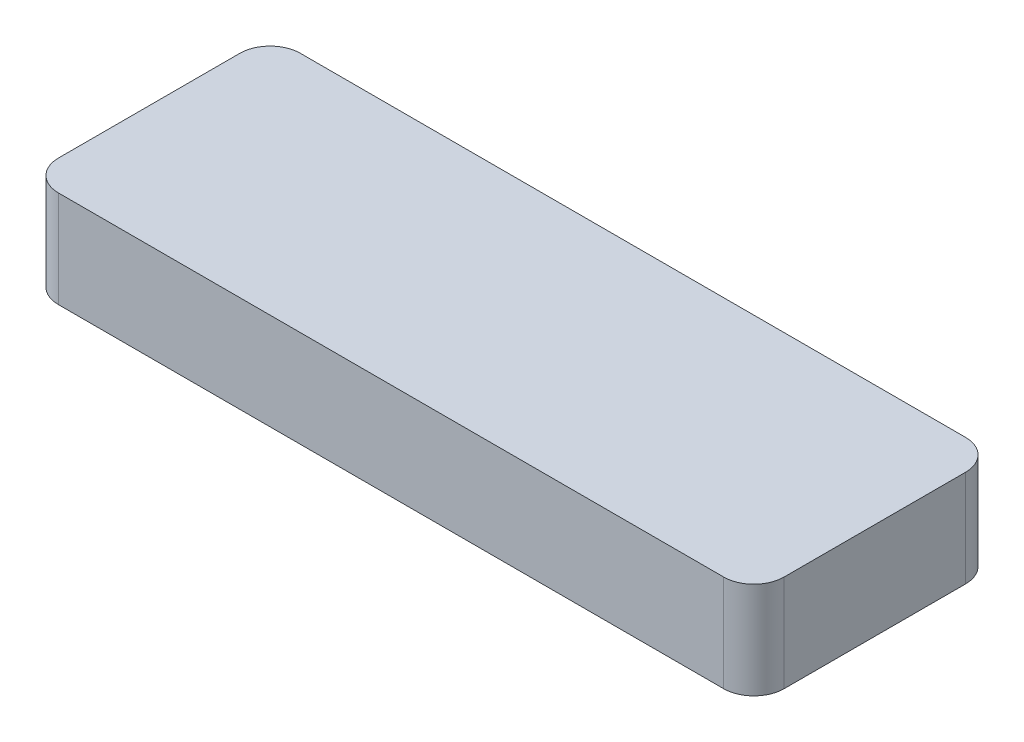
ISO-10303-21;
HEADER;
FILE_DESCRIPTION(('STEP AP214'),'2;1');
FILE_NAME('part.step','',(''),(''),'','','');
FILE_SCHEMA(('AUTOMOTIVE_DESIGN { 1 0 10303 214 1 1 1 1 }'));
ENDSEC;
DATA;
#1=APPLICATION_CONTEXT('core data for automotive mechanical design processes');
#2=APPLICATION_PROTOCOL_DEFINITION('international standard','automotive_design',2000,#1);
#3=PRODUCT_CONTEXT('',#1,'mechanical');
#4=PRODUCT('Part','Part','',(#3));
#5=PRODUCT_RELATED_PRODUCT_CATEGORY('part','',(#4));
#6=PRODUCT_DEFINITION_FORMATION('','',#4);
#7=PRODUCT_DEFINITION_CONTEXT('part definition',#1,'design');
#8=PRODUCT_DEFINITION('design','',#6,#7);
#9=PRODUCT_DEFINITION_SHAPE('','',#8);
#10=(LENGTH_UNIT() NAMED_UNIT(*) SI_UNIT(.MILLI.,.METRE.));
#11=(NAMED_UNIT(*) PLANE_ANGLE_UNIT() SI_UNIT($,.RADIAN.));
#12=(NAMED_UNIT(*) SI_UNIT($,.STERADIAN.) SOLID_ANGLE_UNIT());
#13=UNCERTAINTY_MEASURE_WITH_UNIT(LENGTH_MEASURE(1.E-05),#10,'distance_accuracy_value','');
#14=(GEOMETRIC_REPRESENTATION_CONTEXT(3) GLOBAL_UNCERTAINTY_ASSIGNED_CONTEXT((#13)) GLOBAL_UNIT_ASSIGNED_CONTEXT((#10,
#11,#12)) REPRESENTATION_CONTEXT('',''));
#15=CARTESIAN_POINT('',(0.,0.,0.));
#16=DIRECTION('',(0.,0.,1.));
#17=DIRECTION('',(1.,0.,0.));
#18=AXIS2_PLACEMENT_3D('',#15,#16,#17);
#19=CARTESIAN_POINT('',(60.,16.,-20.));
#20=DIRECTION('',(-1.,0.,0.));
#21=DIRECTION('',(0.,0.,1.));
#22=AXIS2_PLACEMENT_3D('',#19,#20,#21);
#23=PLANE('',#22);
#24=DIRECTION('',(0.,0.,-1.));
#25=VECTOR('',#24,1.);
#26=CARTESIAN_POINT('',(60.,0.,-20.));
#27=LINE('',#26,#25);
#28=CARTESIAN_POINT('',(60.,0.,15.));
#29=VERTEX_POINT('',#28);
#30=CARTESIAN_POINT('',(60.,0.,-15.));
#31=VERTEX_POINT('',#30);
#32=EDGE_CURVE('E140',#29,#31,#27,.T.);
#33=ORIENTED_EDGE('',*,*,#32,.T.);
#34=DIRECTION('',(0.,-1.,0.));
#35=VECTOR('',#34,1.);
#36=CARTESIAN_POINT('',(60.,16.,-15.));
#37=LINE('',#36,#35);
#38=CARTESIAN_POINT('',(60.,16.,-15.));
#39=VERTEX_POINT('',#38);
#40=EDGE_CURVE('E174',#31,#39,#37,.F.);
#41=ORIENTED_EDGE('',*,*,#40,.T.);
#42=DIRECTION('',(0.,0.,-1.));
#43=VECTOR('',#42,1.);
#44=CARTESIAN_POINT('',(60.,16.,-20.));
#45=LINE('',#44,#43);
#46=CARTESIAN_POINT('',(60.,16.,15.));
#47=VERTEX_POINT('',#46);
#48=EDGE_CURVE('E138',#47,#39,#45,.T.);
#49=ORIENTED_EDGE('',*,*,#48,.F.);
#50=DIRECTION('',(0.,-1.,0.));
#51=VECTOR('',#50,1.);
#52=CARTESIAN_POINT('',(60.,16.,15.));
#53=LINE('',#52,#51);
#54=EDGE_CURVE('E170',#47,#29,#53,.T.);
#55=ORIENTED_EDGE('',*,*,#54,.T.);
#56=EDGE_LOOP('',(#33,#41,#49,#55));
#57=FACE_BOUND('',#56,.T.);
#58=ADVANCED_FACE('F39',(#57),#23,.F.);
#59=CARTESIAN_POINT('',(-60.,16.,-20.));
#60=DIRECTION('',(0.,0.,1.));
#61=DIRECTION('',(1.,0.,0.));
#62=AXIS2_PLACEMENT_3D('',#59,#60,#61);
#63=PLANE('',#62);
#64=DIRECTION('',(-1.,0.,0.));
#65=VECTOR('',#64,1.);
#66=CARTESIAN_POINT('',(-60.,0.,-20.));
#67=LINE('',#66,#65);
#68=CARTESIAN_POINT('',(55.,0.,-20.));
#69=VERTEX_POINT('',#68);
#70=CARTESIAN_POINT('',(-55.,0.,-20.));
#71=VERTEX_POINT('',#70);
#72=EDGE_CURVE('E134',#69,#71,#67,.T.);
#73=ORIENTED_EDGE('',*,*,#72,.T.);
#74=DIRECTION('',(0.,-1.,0.));
#75=VECTOR('',#74,1.);
#76=CARTESIAN_POINT('',(-55.,16.,-20.));
#77=LINE('',#76,#75);
#78=CARTESIAN_POINT('',(-55.,16.,-20.));
#79=VERTEX_POINT('',#78);
#80=EDGE_CURVE('E110',#71,#79,#77,.F.);
#81=ORIENTED_EDGE('',*,*,#80,.T.);
#82=DIRECTION('',(-1.,0.,0.));
#83=VECTOR('',#82,1.);
#84=CARTESIAN_POINT('',(-60.,16.,-20.));
#85=LINE('',#84,#83);
#86=CARTESIAN_POINT('',(55.,16.,-20.));
#87=VERTEX_POINT('',#86);
#88=EDGE_CURVE('E193',#87,#79,#85,.T.);
#89=ORIENTED_EDGE('',*,*,#88,.F.);
#90=DIRECTION('',(0.,-1.,0.));
#91=VECTOR('',#90,1.);
#92=CARTESIAN_POINT('',(55.,16.,-20.));
#93=LINE('',#92,#91);
#94=EDGE_CURVE('E116',#87,#69,#93,.T.);
#95=ORIENTED_EDGE('',*,*,#94,.T.);
#96=EDGE_LOOP('',(#73,#81,#89,#95));
#97=FACE_BOUND('',#96,.T.);
#98=ADVANCED_FACE('F214',(#97),#63,.F.);
#99=CARTESIAN_POINT('',(-60.,16.,-20.));
#100=DIRECTION('',(1.,0.,0.));
#101=DIRECTION('',(0.,0.,-1.));
#102=AXIS2_PLACEMENT_3D('',#99,#100,#101);
#103=PLANE('',#102);
#104=DIRECTION('',(0.,0.,1.));
#105=VECTOR('',#104,1.);
#106=CARTESIAN_POINT('',(-60.,16.,-20.));
#107=LINE('',#106,#105);
#108=CARTESIAN_POINT('',(-60.,16.,-15.));
#109=VERTEX_POINT('',#108);
#110=CARTESIAN_POINT('',(-60.,16.,15.));
#111=VERTEX_POINT('',#110);
#112=EDGE_CURVE('E125',#109,#111,#107,.T.);
#113=ORIENTED_EDGE('',*,*,#112,.F.);
#114=DIRECTION('',(0.,-1.,0.));
#115=VECTOR('',#114,1.);
#116=CARTESIAN_POINT('',(-60.,16.,-15.));
#117=LINE('',#116,#115);
#118=CARTESIAN_POINT('',(-60.,0.,-15.));
#119=VERTEX_POINT('',#118);
#120=EDGE_CURVE('E109',#109,#119,#117,.T.);
#121=ORIENTED_EDGE('',*,*,#120,.T.);
#122=DIRECTION('',(0.,0.,1.));
#123=VECTOR('',#122,1.);
#124=CARTESIAN_POINT('',(-60.,0.,-20.));
#125=LINE('',#124,#123);
#126=CARTESIAN_POINT('',(-60.,0.,15.));
#127=VERTEX_POINT('',#126);
#128=EDGE_CURVE('E123',#119,#127,#125,.T.);
#129=ORIENTED_EDGE('',*,*,#128,.T.);
#130=DIRECTION('',(0.,-1.,0.));
#131=VECTOR('',#130,1.);
#132=CARTESIAN_POINT('',(-60.,16.,15.));
#133=LINE('',#132,#131);
#134=EDGE_CURVE('E128',#127,#111,#133,.F.);
#135=ORIENTED_EDGE('',*,*,#134,.T.);
#136=EDGE_LOOP('',(#113,#121,#129,#135));
#137=FACE_BOUND('',#136,.T.);
#138=ADVANCED_FACE('F122',(#137),#103,.F.);
#139=CARTESIAN_POINT('',(-60.,16.,20.));
#140=DIRECTION('',(0.,0.,-1.));
#141=DIRECTION('',(-1.,0.,0.));
#142=AXIS2_PLACEMENT_3D('',#139,#140,#141);
#143=PLANE('',#142);
#144=DIRECTION('',(1.,0.,0.));
#145=VECTOR('',#144,1.);
#146=CARTESIAN_POINT('',(-60.,0.,20.));
#147=LINE('',#146,#145);
#148=CARTESIAN_POINT('',(-55.,0.,20.));
#149=VERTEX_POINT('',#148);
#150=CARTESIAN_POINT('',(55.,0.,20.));
#151=VERTEX_POINT('',#150);
#152=EDGE_CURVE('E133',#149,#151,#147,.T.);
#153=ORIENTED_EDGE('',*,*,#152,.T.);
#154=DIRECTION('',(0.,-1.,0.));
#155=VECTOR('',#154,1.);
#156=CARTESIAN_POINT('',(55.,16.,20.));
#157=LINE('',#156,#155);
#158=CARTESIAN_POINT('',(55.,16.,20.));
#159=VERTEX_POINT('',#158);
#160=EDGE_CURVE('E11',#151,#159,#157,.F.);
#161=ORIENTED_EDGE('',*,*,#160,.T.);
#162=DIRECTION('',(1.,0.,0.));
#163=VECTOR('',#162,1.);
#164=CARTESIAN_POINT('',(-60.,16.,20.));
#165=LINE('',#164,#163);
#166=CARTESIAN_POINT('',(-55.,16.,20.));
#167=VERTEX_POINT('',#166);
#168=EDGE_CURVE('E145',#167,#159,#165,.T.);
#169=ORIENTED_EDGE('',*,*,#168,.F.);
#170=DIRECTION('',(0.,-1.,0.));
#171=VECTOR('',#170,1.);
#172=CARTESIAN_POINT('',(-55.,16.,20.));
#173=LINE('',#172,#171);
#174=EDGE_CURVE('E48',#167,#149,#173,.T.);
#175=ORIENTED_EDGE('',*,*,#174,.T.);
#176=EDGE_LOOP('',(#153,#161,#169,#175));
#177=FACE_BOUND('',#176,.T.);
#178=ADVANCED_FACE('F179',(#177),#143,.F.);
#179=CARTESIAN_POINT('',(0.,16.,0.));
#180=DIRECTION('',(0.,1.,0.));
#181=DIRECTION('',(0.,0.,1.));
#182=AXIS2_PLACEMENT_3D('',#179,#180,#181);
#183=PLANE('',#182);
#184=ORIENTED_EDGE('',*,*,#88,.T.);
#185=CARTESIAN_POINT('',(-55.,16.,-15.));
#186=DIRECTION('',(0.,1.,0.));
#187=DIRECTION('',(0.,0.,1.));
#188=AXIS2_PLACEMENT_3D('',#185,#186,#187);
#189=CIRCLE('',#188,5.);
#190=EDGE_CURVE('E167',#79,#109,#189,.T.);
#191=ORIENTED_EDGE('',*,*,#190,.T.);
#192=ORIENTED_EDGE('',*,*,#112,.T.);
#193=CARTESIAN_POINT('',(-55.,16.,15.));
#194=DIRECTION('',(0.,1.,0.));
#195=DIRECTION('',(0.,0.,1.));
#196=AXIS2_PLACEMENT_3D('',#193,#194,#195);
#197=CIRCLE('',#196,5.);
#198=EDGE_CURVE('E60',#111,#167,#197,.T.);
#199=ORIENTED_EDGE('',*,*,#198,.T.);
#200=ORIENTED_EDGE('',*,*,#168,.T.);
#201=CARTESIAN_POINT('',(55.,16.,15.));
#202=DIRECTION('',(0.,1.,0.));
#203=DIRECTION('',(0.,0.,1.));
#204=AXIS2_PLACEMENT_3D('',#201,#202,#203);
#205=CIRCLE('',#204,5.);
#206=EDGE_CURVE('E161',#159,#47,#205,.T.);
#207=ORIENTED_EDGE('',*,*,#206,.T.);
#208=ORIENTED_EDGE('',*,*,#48,.T.);
#209=CARTESIAN_POINT('',(55.,16.,-15.));
#210=DIRECTION('',(0.,1.,0.));
#211=DIRECTION('',(0.,0.,1.));
#212=AXIS2_PLACEMENT_3D('',#209,#210,#211);
#213=CIRCLE('',#212,5.);
#214=EDGE_CURVE('E164',#39,#87,#213,.T.);
#215=ORIENTED_EDGE('',*,*,#214,.T.);
#216=EDGE_LOOP('',(#184,#191,#192,#199,#200,#207,#208,#215));
#217=FACE_BOUND('',#216,.T.);
#218=ADVANCED_FACE('F203',(#217),#183,.T.);
#219=CARTESIAN_POINT('',(0.,0.,0.));
#220=DIRECTION('',(0.,1.,0.));
#221=DIRECTION('',(0.,0.,1.));
#222=AXIS2_PLACEMENT_3D('',#219,#220,#221);
#223=PLANE('',#222);
#224=ORIENTED_EDGE('',*,*,#128,.F.);
#225=CARTESIAN_POINT('',(-55.,0.,-15.));
#226=DIRECTION('',(0.,1.,0.));
#227=DIRECTION('',(0.,0.,1.));
#228=AXIS2_PLACEMENT_3D('',#225,#226,#227);
#229=CIRCLE('',#228,5.);
#230=EDGE_CURVE('E105',#119,#71,#229,.F.);
#231=ORIENTED_EDGE('',*,*,#230,.T.);
#232=ORIENTED_EDGE('',*,*,#72,.F.);
#233=CARTESIAN_POINT('',(55.,0.,-15.));
#234=DIRECTION('',(0.,1.,0.));
#235=DIRECTION('',(0.,0.,1.));
#236=AXIS2_PLACEMENT_3D('',#233,#234,#235);
#237=CIRCLE('',#236,5.);
#238=EDGE_CURVE('E117',#69,#31,#237,.F.);
#239=ORIENTED_EDGE('',*,*,#238,.T.);
#240=ORIENTED_EDGE('',*,*,#32,.F.);
#241=CARTESIAN_POINT('',(55.,0.,15.));
#242=DIRECTION('',(0.,1.,0.));
#243=DIRECTION('',(0.,0.,1.));
#244=AXIS2_PLACEMENT_3D('',#241,#242,#243);
#245=CIRCLE('',#244,5.);
#246=EDGE_CURVE('E149',#29,#151,#245,.F.);
#247=ORIENTED_EDGE('',*,*,#246,.T.);
#248=ORIENTED_EDGE('',*,*,#152,.F.);
#249=CARTESIAN_POINT('',(-55.,0.,15.));
#250=DIRECTION('',(0.,1.,0.));
#251=DIRECTION('',(0.,0.,1.));
#252=AXIS2_PLACEMENT_3D('',#249,#250,#251);
#253=CIRCLE('',#252,5.);
#254=EDGE_CURVE('E127',#149,#127,#253,.F.);
#255=ORIENTED_EDGE('',*,*,#254,.T.);
#256=EDGE_LOOP('',(#224,#231,#232,#239,#240,#247,#248,#255));
#257=FACE_BOUND('',#256,.T.);
#258=ADVANCED_FACE('F130',(#257),#223,.F.);
#259=CARTESIAN_POINT('',(-55.,16.,-15.));
#260=DIRECTION('',(0.,-1.,0.));
#261=DIRECTION('',(0.,0.,-1.));
#262=AXIS2_PLACEMENT_3D('',#259,#260,#261);
#263=CYLINDRICAL_SURFACE('',#262,5.);
#264=ORIENTED_EDGE('',*,*,#190,.F.);
#265=ORIENTED_EDGE('',*,*,#80,.F.);
#266=ORIENTED_EDGE('',*,*,#230,.F.);
#267=ORIENTED_EDGE('',*,*,#120,.F.);
#268=EDGE_LOOP('',(#264,#265,#266,#267));
#269=FACE_BOUND('',#268,.T.);
#270=ADVANCED_FACE('F108',(#269),#263,.T.);
#271=CARTESIAN_POINT('',(55.,16.,-15.));
#272=DIRECTION('',(0.,-1.,0.));
#273=DIRECTION('',(0.,0.,-1.));
#274=AXIS2_PLACEMENT_3D('',#271,#272,#273);
#275=CYLINDRICAL_SURFACE('',#274,5.);
#276=ORIENTED_EDGE('',*,*,#214,.F.);
#277=ORIENTED_EDGE('',*,*,#40,.F.);
#278=ORIENTED_EDGE('',*,*,#238,.F.);
#279=ORIENTED_EDGE('',*,*,#94,.F.);
#280=EDGE_LOOP('',(#276,#277,#278,#279));
#281=FACE_BOUND('',#280,.T.);
#282=ADVANCED_FACE('F225',(#281),#275,.T.);
#283=CARTESIAN_POINT('',(55.,16.,15.));
#284=DIRECTION('',(0.,-1.,0.));
#285=DIRECTION('',(0.,0.,-1.));
#286=AXIS2_PLACEMENT_3D('',#283,#284,#285);
#287=CYLINDRICAL_SURFACE('',#286,5.);
#288=ORIENTED_EDGE('',*,*,#206,.F.);
#289=ORIENTED_EDGE('',*,*,#160,.F.);
#290=ORIENTED_EDGE('',*,*,#246,.F.);
#291=ORIENTED_EDGE('',*,*,#54,.F.);
#292=EDGE_LOOP('',(#288,#289,#290,#291));
#293=FACE_BOUND('',#292,.T.);
#294=ADVANCED_FACE('F186',(#293),#287,.T.);
#295=CARTESIAN_POINT('',(-55.,16.,15.));
#296=DIRECTION('',(0.,-1.,0.));
#297=DIRECTION('',(0.,0.,-1.));
#298=AXIS2_PLACEMENT_3D('',#295,#296,#297);
#299=CYLINDRICAL_SURFACE('',#298,5.);
#300=ORIENTED_EDGE('',*,*,#198,.F.);
#301=ORIENTED_EDGE('',*,*,#134,.F.);
#302=ORIENTED_EDGE('',*,*,#254,.F.);
#303=ORIENTED_EDGE('',*,*,#174,.F.);
#304=EDGE_LOOP('',(#300,#301,#302,#303));
#305=FACE_BOUND('',#304,.T.);
#306=ADVANCED_FACE('F41',(#305),#299,.T.);
#307=CLOSED_SHELL('',(#58,#98,#138,#178,#218,#258,#270,#282,#294,#306));
#308=MANIFOLD_SOLID_BREP('B2',#307);
#309=ADVANCED_BREP_SHAPE_REPRESENTATION('',(#18,#308),#14);
#310=SHAPE_DEFINITION_REPRESENTATION(#9,#309);
ENDSEC;
END-ISO-10303-21;
